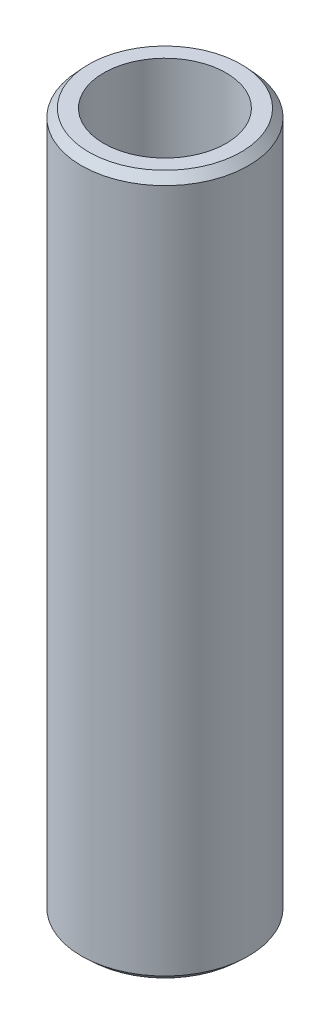
ISO-10303-21;
HEADER;
FILE_DESCRIPTION(('STEP AP214'),'2;1');
FILE_NAME('part.step','',(''),(''),'','','');
FILE_SCHEMA(('AUTOMOTIVE_DESIGN { 1 0 10303 214 1 1 1 1 }'));
ENDSEC;
DATA;
#1=APPLICATION_CONTEXT('core data for automotive mechanical design processes');
#2=APPLICATION_PROTOCOL_DEFINITION('international standard','automotive_design',2000,#1);
#3=PRODUCT_CONTEXT('',#1,'mechanical');
#4=PRODUCT('Part','Part','',(#3));
#5=PRODUCT_RELATED_PRODUCT_CATEGORY('part','',(#4));
#6=PRODUCT_DEFINITION_FORMATION('','',#4);
#7=PRODUCT_DEFINITION_CONTEXT('part definition',#1,'design');
#8=PRODUCT_DEFINITION('design','',#6,#7);
#9=PRODUCT_DEFINITION_SHAPE('','',#8);
#10=(LENGTH_UNIT() NAMED_UNIT(*) SI_UNIT(.MILLI.,.METRE.));
#11=(NAMED_UNIT(*) PLANE_ANGLE_UNIT() SI_UNIT($,.RADIAN.));
#12=(NAMED_UNIT(*) SI_UNIT($,.STERADIAN.) SOLID_ANGLE_UNIT());
#13=UNCERTAINTY_MEASURE_WITH_UNIT(LENGTH_MEASURE(1.E-05),#10,'distance_accuracy_value','');
#14=(GEOMETRIC_REPRESENTATION_CONTEXT(3) GLOBAL_UNCERTAINTY_ASSIGNED_CONTEXT((#13)) GLOBAL_UNIT_ASSIGNED_CONTEXT((#10,
#11,#12)) REPRESENTATION_CONTEXT('',''));
#15=CARTESIAN_POINT('',(0.,0.,0.));
#16=DIRECTION('',(0.,0.,1.));
#17=DIRECTION('',(1.,0.,0.));
#18=AXIS2_PLACEMENT_3D('',#15,#16,#17);
#19=CARTESIAN_POINT('',(0.,502.652044757867,0.));
#20=DIRECTION('',(0.,-1.,0.));
#21=DIRECTION('',(0.,0.,-1.));
#22=AXIS2_PLACEMENT_3D('',#19,#20,#21);
#23=CYLINDRICAL_SURFACE('',#22,60.);
#24=CARTESIAN_POINT('',(0.,496.863202239324,0.));
#25=DIRECTION('',(0.,1.,0.));
#26=DIRECTION('',(0.,0.,1.));
#27=AXIS2_PLACEMENT_3D('',#24,#25,#26);
#28=CIRCLE('',#27,60.);
#29=CARTESIAN_POINT('',(0.,496.863202239324,60.));
#30=VERTEX_POINT('',#29);
#31=EDGE_CURVE('E50',#30,#30,#28,.F.);
#32=ORIENTED_EDGE('',*,*,#31,.T.);
#33=EDGE_LOOP('',(#32));
#34=FACE_BOUND('',#33,.T.);
#35=CARTESIAN_POINT('',(0.,5.33100368360379,0.));
#36=DIRECTION('',(0.,1.,0.));
#37=DIRECTION('',(0.,0.,1.));
#38=AXIS2_PLACEMENT_3D('',#35,#36,#37);
#39=CIRCLE('',#38,60.);
#40=CARTESIAN_POINT('',(0.,5.33100368360379,60.));
#41=VERTEX_POINT('',#40);
#42=EDGE_CURVE('E51',#41,#41,#39,.T.);
#43=ORIENTED_EDGE('',*,*,#42,.T.);
#44=EDGE_LOOP('',(#43));
#45=FACE_BOUND('',#44,.T.);
#46=ADVANCED_FACE('F39',(#34,#45),#23,.T.);
#47=CARTESIAN_POINT('',(0.,502.652044757867,0.));
#48=DIRECTION('',(0.,1.,0.));
#49=DIRECTION('',(0.,0.,1.));
#50=AXIS2_PLACEMENT_3D('',#47,#48,#49);
#51=PLANE('',#50);
#52=CARTESIAN_POINT('',(0.,502.652044757867,0.));
#53=DIRECTION('',(0.,1.,0.));
#54=DIRECTION('',(0.,0.,1.));
#55=AXIS2_PLACEMENT_3D('',#52,#53,#54);
#56=CIRCLE('',#55,54.668996316396);
#57=CARTESIAN_POINT('',(0.,502.652044757867,54.668996316396));
#58=VERTEX_POINT('',#57);
#59=EDGE_CURVE('E54',#58,#58,#56,.T.);
#60=ORIENTED_EDGE('',*,*,#59,.T.);
#61=EDGE_LOOP('',(#60));
#62=FACE_BOUND('',#61,.T.);
#63=CARTESIAN_POINT('',(0.,502.652044757867,0.));
#64=DIRECTION('',(0.,1.,0.));
#65=DIRECTION('',(0.,0.,1.));
#66=AXIS2_PLACEMENT_3D('',#63,#64,#65);
#67=CIRCLE('',#66,43.9306380379104);
#68=CARTESIAN_POINT('',(0.,502.652044757867,43.9306380379104));
#69=VERTEX_POINT('',#68);
#70=EDGE_CURVE('E58',#69,#69,#67,.T.);
#71=ORIENTED_EDGE('',*,*,#70,.F.);
#72=EDGE_LOOP('',(#71));
#73=FACE_BOUND('',#72,.T.);
#74=ADVANCED_FACE('F69',(#62,#73),#51,.T.);
#75=CARTESIAN_POINT('',(0.,0.,0.));
#76=DIRECTION('',(0.,1.,0.));
#77=DIRECTION('',(0.,0.,1.));
#78=AXIS2_PLACEMENT_3D('',#75,#76,#77);
#79=PLANE('',#78);
#80=CARTESIAN_POINT('',(0.,0.,0.));
#81=DIRECTION('',(0.,1.,0.));
#82=DIRECTION('',(0.,0.,1.));
#83=AXIS2_PLACEMENT_3D('',#80,#81,#82);
#84=CIRCLE('',#83,54.2111574814575);
#85=CARTESIAN_POINT('',(0.,0.,54.2111574814575));
#86=VERTEX_POINT('',#85);
#87=EDGE_CURVE('E10',#86,#86,#84,.F.);
#88=ORIENTED_EDGE('',*,*,#87,.T.);
#89=EDGE_LOOP('',(#88));
#90=FACE_BOUND('',#89,.T.);
#91=CARTESIAN_POINT('',(0.,0.,0.));
#92=DIRECTION('',(0.,1.,0.));
#93=DIRECTION('',(0.,0.,1.));
#94=AXIS2_PLACEMENT_3D('',#91,#92,#93);
#95=CIRCLE('',#94,43.9306380379104);
#96=CARTESIAN_POINT('',(0.,0.,43.9306380379104));
#97=VERTEX_POINT('',#96);
#98=EDGE_CURVE('E63',#97,#97,#95,.T.);
#99=ORIENTED_EDGE('',*,*,#98,.T.);
#100=EDGE_LOOP('',(#99));
#101=FACE_BOUND('',#100,.T.);
#102=ADVANCED_FACE('F75',(#90,#101),#79,.F.);
#103=CARTESIAN_POINT('',(0.,502.652044757867,0.));
#104=DIRECTION('',(0.,-1.,0.));
#105=DIRECTION('',(0.,0.,-1.));
#106=AXIS2_PLACEMENT_3D('',#103,#104,#105);
#107=CYLINDRICAL_SURFACE('',#106,43.9306380379104);
#108=ORIENTED_EDGE('',*,*,#70,.T.);
#109=EDGE_LOOP('',(#108));
#110=FACE_BOUND('',#109,.T.);
#111=ORIENTED_EDGE('',*,*,#98,.F.);
#112=EDGE_LOOP('',(#111));
#113=FACE_BOUND('',#112,.T.);
#114=ADVANCED_FACE('F70',(#110,#113),#107,.F.);
#115=CARTESIAN_POINT('',(0.,502.652044757867,0.));
#116=DIRECTION('',(0.,-1.,0.));
#117=DIRECTION('',(0.,0.,-1.));
#118=AXIS2_PLACEMENT_3D('',#115,#116,#117);
#119=CONICAL_SURFACE('',#118,54.668996316396,0.744248279130786);
#120=ORIENTED_EDGE('',*,*,#31,.F.);
#121=EDGE_LOOP('',(#120));
#122=FACE_BOUND('',#121,.T.);
#123=ORIENTED_EDGE('',*,*,#59,.F.);
#124=EDGE_LOOP('',(#123));
#125=FACE_BOUND('',#124,.T.);
#126=ADVANCED_FACE('F81',(#122,#125),#119,.T.);
#127=CARTESIAN_POINT('',(0.,5.33100368360379,0.));
#128=DIRECTION('',(0.,1.,0.));
#129=DIRECTION('',(0.,0.,1.));
#130=AXIS2_PLACEMENT_3D('',#127,#128,#129);
#131=CONICAL_SURFACE('',#130,60.,0.826548047664118);
#132=ORIENTED_EDGE('',*,*,#87,.F.);
#133=EDGE_LOOP('',(#132));
#134=FACE_BOUND('',#133,.T.);
#135=ORIENTED_EDGE('',*,*,#42,.F.);
#136=EDGE_LOOP('',(#135));
#137=FACE_BOUND('',#136,.T.);
#138=ADVANCED_FACE('F45',(#134,#137),#131,.T.);
#139=CLOSED_SHELL('',(#46,#74,#102,#114,#126,#138));
#140=MANIFOLD_SOLID_BREP('B2',#139);
#141=ADVANCED_BREP_SHAPE_REPRESENTATION('',(#18,#140),#14);
#142=SHAPE_DEFINITION_REPRESENTATION(#9,#141);
ENDSEC;
END-ISO-10303-21;
